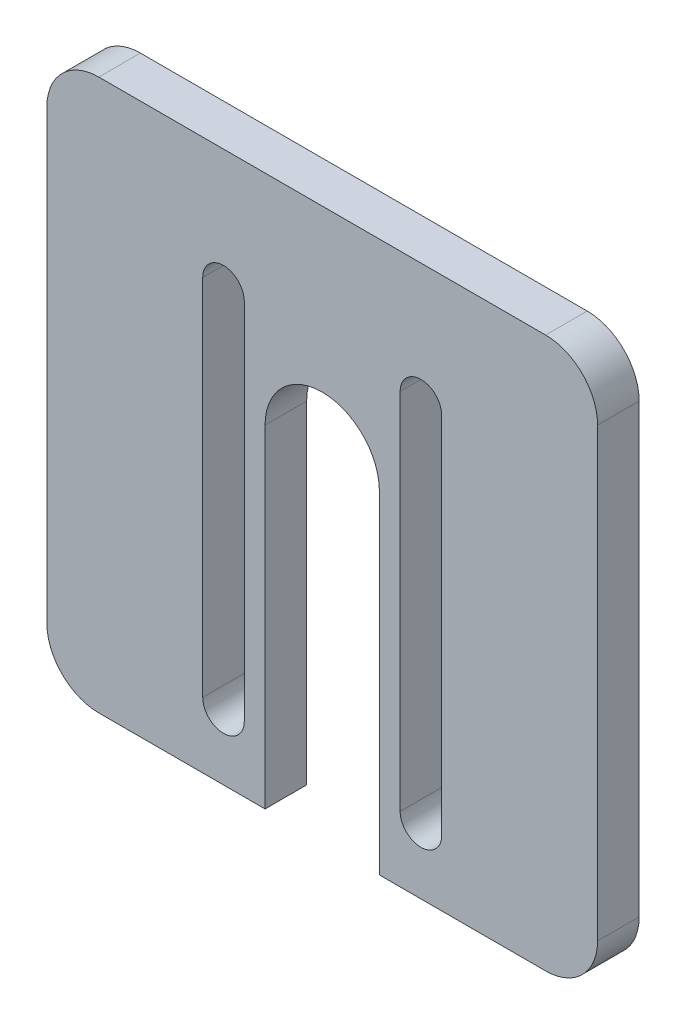
ISO-10303-21;
HEADER;
FILE_DESCRIPTION(('STEP AP214'),'2;1');
FILE_NAME('part.step','',(''),(''),'','','');
FILE_SCHEMA(('AUTOMOTIVE_DESIGN { 1 0 10303 214 1 1 1 1 }'));
ENDSEC;
DATA;
#1=APPLICATION_CONTEXT('core data for automotive mechanical design processes');
#2=APPLICATION_PROTOCOL_DEFINITION('international standard','automotive_design',2000,#1);
#3=PRODUCT_CONTEXT('',#1,'mechanical');
#4=PRODUCT('Part','Part','',(#3));
#5=PRODUCT_RELATED_PRODUCT_CATEGORY('part','',(#4));
#6=PRODUCT_DEFINITION_FORMATION('','',#4);
#7=PRODUCT_DEFINITION_CONTEXT('part definition',#1,'design');
#8=PRODUCT_DEFINITION('design','',#6,#7);
#9=PRODUCT_DEFINITION_SHAPE('','',#8);
#10=(LENGTH_UNIT() NAMED_UNIT(*) SI_UNIT(.MILLI.,.METRE.));
#11=(NAMED_UNIT(*) PLANE_ANGLE_UNIT() SI_UNIT($,.RADIAN.));
#12=(NAMED_UNIT(*) SI_UNIT($,.STERADIAN.) SOLID_ANGLE_UNIT());
#13=UNCERTAINTY_MEASURE_WITH_UNIT(LENGTH_MEASURE(1.E-05),#10,'distance_accuracy_value','');
#14=(GEOMETRIC_REPRESENTATION_CONTEXT(3) GLOBAL_UNCERTAINTY_ASSIGNED_CONTEXT((#13)) GLOBAL_UNIT_ASSIGNED_CONTEXT((#10,
#11,#12)) REPRESENTATION_CONTEXT('',''));
#15=CARTESIAN_POINT('',(0.,0.,0.));
#16=DIRECTION('',(0.,0.,1.));
#17=DIRECTION('',(1.,0.,0.));
#18=AXIS2_PLACEMENT_3D('',#15,#16,#17);
#19=CARTESIAN_POINT('',(17.,6.30020621537469,4.));
#20=DIRECTION('',(0.,0.,-1.));
#21=DIRECTION('',(-1.,0.,0.));
#22=AXIS2_PLACEMENT_3D('',#19,#20,#21);
#23=CYLINDRICAL_SURFACE('',#22,2.);
#24=CARTESIAN_POINT('',(17.,6.30020621537469,0.));
#25=DIRECTION('',(0.,0.,1.));
#26=DIRECTION('',(1.,0.,0.));
#27=AXIS2_PLACEMENT_3D('',#24,#25,#26);
#28=CIRCLE('',#27,2.);
#29=CARTESIAN_POINT('',(15.,6.30020621537469,0.));
#30=VERTEX_POINT('',#29);
#31=CARTESIAN_POINT('',(19.,6.30020621537469,0.));
#32=VERTEX_POINT('',#31);
#33=EDGE_CURVE('E332',#30,#32,#28,.T.);
#34=ORIENTED_EDGE('',*,*,#33,.F.);
#35=DIRECTION('',(0.,0.,-1.));
#36=VECTOR('',#35,1.);
#37=CARTESIAN_POINT('',(15.,6.30020621537469,4.));
#38=LINE('',#37,#36);
#39=CARTESIAN_POINT('',(15.,6.30020621537469,4.));
#40=VERTEX_POINT('',#39);
#41=EDGE_CURVE('E11',#40,#30,#38,.T.);
#42=ORIENTED_EDGE('',*,*,#41,.F.);
#43=CARTESIAN_POINT('',(17.,6.30020621537469,4.));
#44=DIRECTION('',(0.,0.,1.));
#45=DIRECTION('',(1.,0.,0.));
#46=AXIS2_PLACEMENT_3D('',#43,#44,#45);
#47=CIRCLE('',#46,2.);
#48=CARTESIAN_POINT('',(19.,6.30020621537469,4.));
#49=VERTEX_POINT('',#48);
#50=EDGE_CURVE('E198',#40,#49,#47,.T.);
#51=ORIENTED_EDGE('',*,*,#50,.T.);
#52=DIRECTION('',(0.,0.,-1.));
#53=VECTOR('',#52,1.);
#54=CARTESIAN_POINT('',(19.,6.30020621537469,4.));
#55=LINE('',#54,#53);
#56=EDGE_CURVE('E59',#49,#32,#55,.T.);
#57=ORIENTED_EDGE('',*,*,#56,.T.);
#58=EDGE_LOOP('',(#34,#42,#51,#57));
#59=FACE_BOUND('',#58,.T.);
#60=ADVANCED_FACE('F39',(#59),#23,.F.);
#61=CARTESIAN_POINT('',(15.,0.,4.));
#62=DIRECTION('',(-1.,0.,0.));
#63=DIRECTION('',(0.,0.,1.));
#64=AXIS2_PLACEMENT_3D('',#61,#62,#63);
#65=PLANE('',#64);
#66=DIRECTION('',(0.,1.,0.));
#67=VECTOR('',#66,1.);
#68=CARTESIAN_POINT('',(15.,0.,0.));
#69=LINE('',#68,#67);
#70=CARTESIAN_POINT('',(15.,41.3002062153747,0.));
#71=VERTEX_POINT('',#70);
#72=EDGE_CURVE('E204',#30,#71,#69,.T.);
#73=ORIENTED_EDGE('',*,*,#72,.T.);
#74=DIRECTION('',(0.,0.,-1.));
#75=VECTOR('',#74,1.);
#76=CARTESIAN_POINT('',(15.,41.3002062153747,4.));
#77=LINE('',#76,#75);
#78=CARTESIAN_POINT('',(15.,41.3002062153747,4.));
#79=VERTEX_POINT('',#78);
#80=EDGE_CURVE('E50',#79,#71,#77,.T.);
#81=ORIENTED_EDGE('',*,*,#80,.F.);
#82=DIRECTION('',(0.,1.,0.));
#83=VECTOR('',#82,1.);
#84=CARTESIAN_POINT('',(15.,0.,4.));
#85=LINE('',#84,#83);
#86=EDGE_CURVE('E193',#40,#79,#85,.T.);
#87=ORIENTED_EDGE('',*,*,#86,.F.);
#88=ORIENTED_EDGE('',*,*,#41,.T.);
#89=EDGE_LOOP('',(#73,#81,#87,#88));
#90=FACE_BOUND('',#89,.T.);
#91=ADVANCED_FACE('F202',(#90),#65,.F.);
#92=CARTESIAN_POINT('',(17.,41.3002062153747,4.));
#93=DIRECTION('',(0.,0.,-1.));
#94=DIRECTION('',(-1.,0.,0.));
#95=AXIS2_PLACEMENT_3D('',#92,#93,#94);
#96=CYLINDRICAL_SURFACE('',#95,2.);
#97=CARTESIAN_POINT('',(17.,41.3002062153747,0.));
#98=DIRECTION('',(0.,0.,1.));
#99=DIRECTION('',(1.,0.,0.));
#100=AXIS2_PLACEMENT_3D('',#97,#98,#99);
#101=CIRCLE('',#100,2.);
#102=CARTESIAN_POINT('',(19.,41.3002062153747,0.));
#103=VERTEX_POINT('',#102);
#104=EDGE_CURVE('E337',#71,#103,#101,.F.);
#105=ORIENTED_EDGE('',*,*,#104,.T.);
#106=DIRECTION('',(0.,0.,-1.));
#107=VECTOR('',#106,1.);
#108=CARTESIAN_POINT('',(19.,41.3002062153747,4.));
#109=LINE('',#108,#107);
#110=CARTESIAN_POINT('',(19.,41.3002062153747,4.));
#111=VERTEX_POINT('',#110);
#112=EDGE_CURVE('E121',#111,#103,#109,.T.);
#113=ORIENTED_EDGE('',*,*,#112,.F.);
#114=CARTESIAN_POINT('',(17.,41.3002062153747,4.));
#115=DIRECTION('',(0.,0.,1.));
#116=DIRECTION('',(1.,0.,0.));
#117=AXIS2_PLACEMENT_3D('',#114,#115,#116);
#118=CIRCLE('',#117,2.);
#119=EDGE_CURVE('E184',#79,#111,#118,.F.);
#120=ORIENTED_EDGE('',*,*,#119,.F.);
#121=ORIENTED_EDGE('',*,*,#80,.T.);
#122=EDGE_LOOP('',(#105,#113,#120,#121));
#123=FACE_BOUND('',#122,.T.);
#124=ADVANCED_FACE('F186',(#123),#96,.F.);
#125=CARTESIAN_POINT('',(36.,41.3002062153747,4.));
#126=DIRECTION('',(0.,0.,-1.));
#127=DIRECTION('',(-1.,0.,0.));
#128=AXIS2_PLACEMENT_3D('',#125,#126,#127);
#129=CYLINDRICAL_SURFACE('',#128,2.);
#130=CARTESIAN_POINT('',(36.,41.3002062153747,0.));
#131=DIRECTION('',(0.,0.,1.));
#132=DIRECTION('',(1.,0.,0.));
#133=AXIS2_PLACEMENT_3D('',#130,#131,#132);
#134=CIRCLE('',#133,2.);
#135=CARTESIAN_POINT('',(38.,41.3002062153747,0.));
#136=VERTEX_POINT('',#135);
#137=CARTESIAN_POINT('',(34.,41.3002062153747,0.));
#138=VERTEX_POINT('',#137);
#139=EDGE_CURVE('E316',#136,#138,#134,.T.);
#140=ORIENTED_EDGE('',*,*,#139,.F.);
#141=DIRECTION('',(0.,0.,-1.));
#142=VECTOR('',#141,1.);
#143=CARTESIAN_POINT('',(38.,41.3002062153747,4.));
#144=LINE('',#143,#142);
#145=CARTESIAN_POINT('',(38.,41.3002062153747,4.));
#146=VERTEX_POINT('',#145);
#147=EDGE_CURVE('E221',#146,#136,#144,.T.);
#148=ORIENTED_EDGE('',*,*,#147,.F.);
#149=CARTESIAN_POINT('',(36.,41.3002062153747,4.));
#150=DIRECTION('',(0.,0.,1.));
#151=DIRECTION('',(1.,0.,0.));
#152=AXIS2_PLACEMENT_3D('',#149,#150,#151);
#153=CIRCLE('',#152,2.);
#154=CARTESIAN_POINT('',(34.,41.3002062153747,4.));
#155=VERTEX_POINT('',#154);
#156=EDGE_CURVE('E386',#146,#155,#153,.T.);
#157=ORIENTED_EDGE('',*,*,#156,.T.);
#158=DIRECTION('',(0.,0.,-1.));
#159=VECTOR('',#158,1.);
#160=CARTESIAN_POINT('',(34.,41.3002062153747,4.));
#161=LINE('',#160,#159);
#162=EDGE_CURVE('E211',#155,#138,#161,.T.);
#163=ORIENTED_EDGE('',*,*,#162,.T.);
#164=EDGE_LOOP('',(#140,#148,#157,#163));
#165=FACE_BOUND('',#164,.T.);
#166=ADVANCED_FACE('F436',(#165),#129,.F.);
#167=CARTESIAN_POINT('',(38.,0.,4.));
#168=DIRECTION('',(-1.,0.,0.));
#169=DIRECTION('',(0.,-1.,0.));
#170=AXIS2_PLACEMENT_3D('',#167,#168,#169);
#171=PLANE('',#170);
#172=DIRECTION('',(0.,1.,0.));
#173=VECTOR('',#172,1.);
#174=CARTESIAN_POINT('',(38.,0.,0.));
#175=LINE('',#174,#173);
#176=CARTESIAN_POINT('',(38.,6.30020621537469,0.));
#177=VERTEX_POINT('',#176);
#178=EDGE_CURVE('E320',#177,#136,#175,.T.);
#179=ORIENTED_EDGE('',*,*,#178,.F.);
#180=DIRECTION('',(0.,0.,-1.));
#181=VECTOR('',#180,1.);
#182=CARTESIAN_POINT('',(38.,6.30020621537469,4.));
#183=LINE('',#182,#181);
#184=CARTESIAN_POINT('',(38.,6.30020621537469,4.));
#185=VERTEX_POINT('',#184);
#186=EDGE_CURVE('E218',#185,#177,#183,.T.);
#187=ORIENTED_EDGE('',*,*,#186,.F.);
#188=DIRECTION('',(0.,1.,0.));
#189=VECTOR('',#188,1.);
#190=CARTESIAN_POINT('',(38.,0.,4.));
#191=LINE('',#190,#189);
#192=EDGE_CURVE('E390',#185,#146,#191,.T.);
#193=ORIENTED_EDGE('',*,*,#192,.T.);
#194=ORIENTED_EDGE('',*,*,#147,.T.);
#195=EDGE_LOOP('',(#179,#187,#193,#194));
#196=FACE_BOUND('',#195,.T.);
#197=ADVANCED_FACE('F432',(#196),#171,.T.);
#198=CARTESIAN_POINT('',(36.,6.30020621537469,4.));
#199=DIRECTION('',(0.,0.,-1.));
#200=DIRECTION('',(-1.,0.,0.));
#201=AXIS2_PLACEMENT_3D('',#198,#199,#200);
#202=CYLINDRICAL_SURFACE('',#201,2.);
#203=CARTESIAN_POINT('',(36.,6.30020621537469,0.));
#204=DIRECTION('',(0.,0.,1.));
#205=DIRECTION('',(1.,0.,0.));
#206=AXIS2_PLACEMENT_3D('',#203,#204,#205);
#207=CIRCLE('',#206,2.);
#208=CARTESIAN_POINT('',(34.,6.30020621537469,0.));
#209=VERTEX_POINT('',#208);
#210=EDGE_CURVE('E324',#177,#209,#207,.F.);
#211=ORIENTED_EDGE('',*,*,#210,.T.);
#212=DIRECTION('',(0.,0.,-1.));
#213=VECTOR('',#212,1.);
#214=CARTESIAN_POINT('',(34.,6.30020621537469,4.));
#215=LINE('',#214,#213);
#216=CARTESIAN_POINT('',(34.,6.30020621537469,4.));
#217=VERTEX_POINT('',#216);
#218=EDGE_CURVE('E214',#217,#209,#215,.T.);
#219=ORIENTED_EDGE('',*,*,#218,.F.);
#220=CARTESIAN_POINT('',(36.,6.30020621537469,4.));
#221=DIRECTION('',(0.,0.,1.));
#222=DIRECTION('',(1.,0.,0.));
#223=AXIS2_PLACEMENT_3D('',#220,#221,#222);
#224=CIRCLE('',#223,2.);
#225=EDGE_CURVE('E394',#185,#217,#224,.F.);
#226=ORIENTED_EDGE('',*,*,#225,.F.);
#227=ORIENTED_EDGE('',*,*,#186,.T.);
#228=EDGE_LOOP('',(#211,#219,#226,#227));
#229=FACE_BOUND('',#228,.T.);
#230=ADVANCED_FACE('F429',(#229),#202,.F.);
#231=CARTESIAN_POINT('',(5.,48.,4.));
#232=DIRECTION('',(0.,0.,-1.));
#233=DIRECTION('',(-1.,0.,0.));
#234=AXIS2_PLACEMENT_3D('',#231,#232,#233);
#235=CYLINDRICAL_SURFACE('',#234,5.);
#236=CARTESIAN_POINT('',(5.,48.,0.));
#237=DIRECTION('',(0.,0.,1.));
#238=DIRECTION('',(1.,0.,0.));
#239=AXIS2_PLACEMENT_3D('',#236,#237,#238);
#240=CIRCLE('',#239,5.);
#241=CARTESIAN_POINT('',(0.,48.,0.));
#242=VERTEX_POINT('',#241);
#243=CARTESIAN_POINT('',(5.00000000000004,53.,0.));
#244=VERTEX_POINT('',#243);
#245=EDGE_CURVE('E270',#242,#244,#240,.F.);
#246=ORIENTED_EDGE('',*,*,#245,.F.);
#247=DIRECTION('',(0.,0.,-1.));
#248=VECTOR('',#247,1.);
#249=CARTESIAN_POINT('',(0.,48.,4.));
#250=LINE('',#249,#248);
#251=CARTESIAN_POINT('',(0.,48.,4.));
#252=VERTEX_POINT('',#251);
#253=EDGE_CURVE('E43',#252,#242,#250,.T.);
#254=ORIENTED_EDGE('',*,*,#253,.F.);
#255=CARTESIAN_POINT('',(5.,48.,4.));
#256=DIRECTION('',(0.,0.,1.));
#257=DIRECTION('',(1.,0.,0.));
#258=AXIS2_PLACEMENT_3D('',#255,#256,#257);
#259=CIRCLE('',#258,5.);
#260=CARTESIAN_POINT('',(5.00000000000004,53.,4.));
#261=VERTEX_POINT('',#260);
#262=EDGE_CURVE('E343',#252,#261,#259,.F.);
#263=ORIENTED_EDGE('',*,*,#262,.T.);
#264=DIRECTION('',(0.,0.,-1.));
#265=VECTOR('',#264,1.);
#266=CARTESIAN_POINT('',(5.00000000000004,53.,4.));
#267=LINE('',#266,#265);
#268=EDGE_CURVE('E224',#261,#244,#267,.T.);
#269=ORIENTED_EDGE('',*,*,#268,.T.);
#270=EDGE_LOOP('',(#246,#254,#263,#269));
#271=FACE_BOUND('',#270,.T.);
#272=ADVANCED_FACE('F41',(#271),#235,.T.);
#273=CARTESIAN_POINT('',(0.,0.,4.));
#274=DIRECTION('',(-1.,0.,0.));
#275=DIRECTION('',(0.,0.,1.));
#276=AXIS2_PLACEMENT_3D('',#273,#274,#275);
#277=PLANE('',#276);
#278=DIRECTION('',(0.,1.,0.));
#279=VECTOR('',#278,1.);
#280=CARTESIAN_POINT('',(0.,0.,0.));
#281=LINE('',#280,#279);
#282=CARTESIAN_POINT('',(0.,5.00000000000004,0.));
#283=VERTEX_POINT('',#282);
#284=EDGE_CURVE('E266',#283,#242,#281,.T.);
#285=ORIENTED_EDGE('',*,*,#284,.F.);
#286=DIRECTION('',(0.,0.,-1.));
#287=VECTOR('',#286,1.);
#288=CARTESIAN_POINT('',(0.,5.00000000000004,4.));
#289=LINE('',#288,#287);
#290=CARTESIAN_POINT('',(0.,5.00000000000004,4.));
#291=VERTEX_POINT('',#290);
#292=EDGE_CURVE('E254',#291,#283,#289,.T.);
#293=ORIENTED_EDGE('',*,*,#292,.F.);
#294=DIRECTION('',(0.,1.,0.));
#295=VECTOR('',#294,1.);
#296=CARTESIAN_POINT('',(0.,0.,4.));
#297=LINE('',#296,#295);
#298=EDGE_CURVE('E268',#291,#252,#297,.T.);
#299=ORIENTED_EDGE('',*,*,#298,.T.);
#300=ORIENTED_EDGE('',*,*,#253,.T.);
#301=EDGE_LOOP('',(#285,#293,#299,#300));
#302=FACE_BOUND('',#301,.T.);
#303=ADVANCED_FACE('F264',(#302),#277,.T.);
#304=CARTESIAN_POINT('',(5.,5.,4.));
#305=DIRECTION('',(0.,0.,-1.));
#306=DIRECTION('',(-1.,0.,0.));
#307=AXIS2_PLACEMENT_3D('',#304,#305,#306);
#308=CYLINDRICAL_SURFACE('',#307,5.);
#309=CARTESIAN_POINT('',(5.,5.,0.));
#310=DIRECTION('',(0.,0.,1.));
#311=DIRECTION('',(1.,0.,0.));
#312=AXIS2_PLACEMENT_3D('',#309,#310,#311);
#313=CIRCLE('',#312,5.);
#314=CARTESIAN_POINT('',(5.00000000000004,0.,0.));
#315=VERTEX_POINT('',#314);
#316=EDGE_CURVE('E279',#283,#315,#313,.T.);
#317=ORIENTED_EDGE('',*,*,#316,.T.);
#318=DIRECTION('',(0.,0.,-1.));
#319=VECTOR('',#318,1.);
#320=CARTESIAN_POINT('',(5.00000000000004,0.,4.));
#321=LINE('',#320,#319);
#322=CARTESIAN_POINT('',(5.00000000000004,0.,4.));
#323=VERTEX_POINT('',#322);
#324=EDGE_CURVE('E252',#323,#315,#321,.T.);
#325=ORIENTED_EDGE('',*,*,#324,.F.);
#326=CARTESIAN_POINT('',(5.,5.,4.));
#327=DIRECTION('',(0.,0.,1.));
#328=DIRECTION('',(1.,0.,0.));
#329=AXIS2_PLACEMENT_3D('',#326,#327,#328);
#330=CIRCLE('',#329,5.);
#331=EDGE_CURVE('E350',#291,#323,#330,.T.);
#332=ORIENTED_EDGE('',*,*,#331,.F.);
#333=ORIENTED_EDGE('',*,*,#292,.T.);
#334=EDGE_LOOP('',(#317,#325,#332,#333));
#335=FACE_BOUND('',#334,.T.);
#336=ADVANCED_FACE('F469',(#335),#308,.T.);
#337=CARTESIAN_POINT('',(0.,0.,4.));
#338=DIRECTION('',(0.,-1.,0.));
#339=DIRECTION('',(1.,0.,0.));
#340=AXIS2_PLACEMENT_3D('',#337,#338,#339);
#341=PLANE('',#340);
#342=DIRECTION('',(-1.,0.,0.));
#343=VECTOR('',#342,1.);
#344=CARTESIAN_POINT('',(0.,0.,0.));
#345=LINE('',#344,#343);
#346=CARTESIAN_POINT('',(21.,0.,0.));
#347=VERTEX_POINT('',#346);
#348=EDGE_CURVE('E283',#347,#315,#345,.T.);
#349=ORIENTED_EDGE('',*,*,#348,.F.);
#350=DIRECTION('',(0.,0.,-1.));
#351=VECTOR('',#350,1.);
#352=CARTESIAN_POINT('',(21.,0.,4.));
#353=LINE('',#352,#351);
#354=CARTESIAN_POINT('',(21.,0.,4.));
#355=VERTEX_POINT('',#354);
#356=EDGE_CURVE('E249',#355,#347,#353,.T.);
#357=ORIENTED_EDGE('',*,*,#356,.F.);
#358=DIRECTION('',(-1.,0.,0.));
#359=VECTOR('',#358,1.);
#360=CARTESIAN_POINT('',(0.,0.,4.));
#361=LINE('',#360,#359);
#362=EDGE_CURVE('E355',#355,#323,#361,.T.);
#363=ORIENTED_EDGE('',*,*,#362,.T.);
#364=ORIENTED_EDGE('',*,*,#324,.T.);
#365=EDGE_LOOP('',(#349,#357,#363,#364));
#366=FACE_BOUND('',#365,.T.);
#367=ADVANCED_FACE('F457',(#366),#341,.T.);
#368=CARTESIAN_POINT('',(21.,0.,4.));
#369=DIRECTION('',(1.,0.,0.));
#370=DIRECTION('',(0.,0.,-1.));
#371=AXIS2_PLACEMENT_3D('',#368,#369,#370);
#372=PLANE('',#371);
#373=DIRECTION('',(0.,-1.,0.));
#374=VECTOR('',#373,1.);
#375=CARTESIAN_POINT('',(21.,0.,0.));
#376=LINE('',#375,#374);
#377=CARTESIAN_POINT('',(21.,31.9949965699704,0.));
#378=VERTEX_POINT('',#377);
#379=EDGE_CURVE('E289',#378,#347,#376,.T.);
#380=ORIENTED_EDGE('',*,*,#379,.F.);
#381=DIRECTION('',(0.,0.,-1.));
#382=VECTOR('',#381,1.);
#383=CARTESIAN_POINT('',(21.,31.9949965699704,4.));
#384=LINE('',#383,#382);
#385=CARTESIAN_POINT('',(21.,31.9949965699704,4.));
#386=VERTEX_POINT('',#385);
#387=EDGE_CURVE('E246',#386,#378,#384,.T.);
#388=ORIENTED_EDGE('',*,*,#387,.F.);
#389=DIRECTION('',(0.,-1.,0.));
#390=VECTOR('',#389,1.);
#391=CARTESIAN_POINT('',(21.,0.,4.));
#392=LINE('',#391,#390);
#393=EDGE_CURVE('E359',#386,#355,#392,.T.);
#394=ORIENTED_EDGE('',*,*,#393,.T.);
#395=ORIENTED_EDGE('',*,*,#356,.T.);
#396=EDGE_LOOP('',(#380,#388,#394,#395));
#397=FACE_BOUND('',#396,.T.);
#398=ADVANCED_FACE('F464',(#397),#372,.T.);
#399=CARTESIAN_POINT('',(26.5,31.9949965699704,4.));
#400=DIRECTION('',(0.,0.,-1.));
#401=DIRECTION('',(-1.,0.,0.));
#402=AXIS2_PLACEMENT_3D('',#399,#400,#401);
#403=CYLINDRICAL_SURFACE('',#402,5.5);
#404=CARTESIAN_POINT('',(26.5,31.9949965699704,0.));
#405=DIRECTION('',(0.,0.,1.));
#406=DIRECTION('',(1.,0.,0.));
#407=AXIS2_PLACEMENT_3D('',#404,#405,#406);
#408=CIRCLE('',#407,5.5);
#409=CARTESIAN_POINT('',(32.,31.9949965699704,0.));
#410=VERTEX_POINT('',#409);
#411=EDGE_CURVE('E294',#378,#410,#408,.F.);
#412=ORIENTED_EDGE('',*,*,#411,.T.);
#413=DIRECTION('',(0.,0.,-1.));
#414=VECTOR('',#413,1.);
#415=CARTESIAN_POINT('',(32.,31.9949965699704,4.));
#416=LINE('',#415,#414);
#417=CARTESIAN_POINT('',(32.,31.9949965699704,4.));
#418=VERTEX_POINT('',#417);
#419=EDGE_CURVE('E242',#418,#410,#416,.T.);
#420=ORIENTED_EDGE('',*,*,#419,.F.);
#421=CARTESIAN_POINT('',(26.5,31.9949965699704,4.));
#422=DIRECTION('',(0.,0.,1.));
#423=DIRECTION('',(1.,0.,0.));
#424=AXIS2_PLACEMENT_3D('',#421,#422,#423);
#425=CIRCLE('',#424,5.5);
#426=EDGE_CURVE('E364',#386,#418,#425,.F.);
#427=ORIENTED_EDGE('',*,*,#426,.F.);
#428=ORIENTED_EDGE('',*,*,#387,.T.);
#429=EDGE_LOOP('',(#412,#420,#427,#428));
#430=FACE_BOUND('',#429,.T.);
#431=ADVANCED_FACE('F460',(#430),#403,.F.);
#432=CARTESIAN_POINT('',(32.,0.,4.));
#433=DIRECTION('',(1.,0.,0.));
#434=DIRECTION('',(0.,0.,-1.));
#435=AXIS2_PLACEMENT_3D('',#432,#433,#434);
#436=PLANE('',#435);
#437=DIRECTION('',(0.,-1.,0.));
#438=VECTOR('',#437,1.);
#439=CARTESIAN_POINT('',(32.,0.,0.));
#440=LINE('',#439,#438);
#441=CARTESIAN_POINT('',(32.,0.,0.));
#442=VERTEX_POINT('',#441);
#443=EDGE_CURVE('E297',#410,#442,#440,.T.);
#444=ORIENTED_EDGE('',*,*,#443,.T.);
#445=DIRECTION('',(0.,0.,-1.));
#446=VECTOR('',#445,1.);
#447=CARTESIAN_POINT('',(32.,0.,4.));
#448=LINE('',#447,#446);
#449=CARTESIAN_POINT('',(32.,0.,4.));
#450=VERTEX_POINT('',#449);
#451=EDGE_CURVE('E239',#450,#442,#448,.T.);
#452=ORIENTED_EDGE('',*,*,#451,.F.);
#453=DIRECTION('',(0.,-1.,0.));
#454=VECTOR('',#453,1.);
#455=CARTESIAN_POINT('',(32.,0.,4.));
#456=LINE('',#455,#454);
#457=EDGE_CURVE('E367',#418,#450,#456,.T.);
#458=ORIENTED_EDGE('',*,*,#457,.F.);
#459=ORIENTED_EDGE('',*,*,#419,.T.);
#460=EDGE_LOOP('',(#444,#452,#458,#459));
#461=FACE_BOUND('',#460,.T.);
#462=ADVANCED_FACE('F455',(#461),#436,.F.);
#463=CARTESIAN_POINT('',(48.,0.,0.));
#464=VERTEX_POINT('',#463);
#465=EDGE_CURVE('E290',#464,#442,#345,.T.);
#466=ORIENTED_EDGE('',*,*,#465,.F.);
#467=DIRECTION('',(0.,0.,-1.));
#468=VECTOR('',#467,1.);
#469=CARTESIAN_POINT('',(48.,0.,4.));
#470=LINE('',#469,#468);
#471=CARTESIAN_POINT('',(48.,0.,4.));
#472=VERTEX_POINT('',#471);
#473=EDGE_CURVE('E236',#472,#464,#470,.T.);
#474=ORIENTED_EDGE('',*,*,#473,.F.);
#475=EDGE_CURVE('E360',#472,#450,#361,.T.);
#476=ORIENTED_EDGE('',*,*,#475,.T.);
#477=ORIENTED_EDGE('',*,*,#451,.T.);
#478=EDGE_LOOP('',(#466,#474,#476,#477));
#479=FACE_BOUND('',#478,.T.);
#480=ADVANCED_FACE('F451',(#479),#341,.T.);
#481=CARTESIAN_POINT('',(48.,5.,4.));
#482=DIRECTION('',(0.,0.,-1.));
#483=DIRECTION('',(-1.,0.,0.));
#484=AXIS2_PLACEMENT_3D('',#481,#482,#483);
#485=CYLINDRICAL_SURFACE('',#484,5.);
#486=CARTESIAN_POINT('',(48.,5.,0.));
#487=DIRECTION('',(0.,0.,1.));
#488=DIRECTION('',(1.,0.,0.));
#489=AXIS2_PLACEMENT_3D('',#486,#487,#488);
#490=CIRCLE('',#489,5.);
#491=CARTESIAN_POINT('',(53.,5.00000000000004,0.));
#492=VERTEX_POINT('',#491);
#493=EDGE_CURVE('E301',#492,#464,#490,.F.);
#494=ORIENTED_EDGE('',*,*,#493,.F.);
#495=DIRECTION('',(0.,0.,-1.));
#496=VECTOR('',#495,1.);
#497=CARTESIAN_POINT('',(53.,5.00000000000004,4.));
#498=LINE('',#497,#496);
#499=CARTESIAN_POINT('',(53.,5.00000000000004,4.));
#500=VERTEX_POINT('',#499);
#501=EDGE_CURVE('E233',#500,#492,#498,.T.);
#502=ORIENTED_EDGE('',*,*,#501,.F.);
#503=CARTESIAN_POINT('',(48.,5.,4.));
#504=DIRECTION('',(0.,0.,1.));
#505=DIRECTION('',(1.,0.,0.));
#506=AXIS2_PLACEMENT_3D('',#503,#504,#505);
#507=CIRCLE('',#506,5.);
#508=EDGE_CURVE('E370',#500,#472,#507,.F.);
#509=ORIENTED_EDGE('',*,*,#508,.T.);
#510=ORIENTED_EDGE('',*,*,#473,.T.);
#511=EDGE_LOOP('',(#494,#502,#509,#510));
#512=FACE_BOUND('',#511,.T.);
#513=ADVANCED_FACE('F447',(#512),#485,.T.);
#514=CARTESIAN_POINT('',(53.,0.,4.));
#515=DIRECTION('',(1.,0.,0.));
#516=DIRECTION('',(0.,1.,0.));
#517=AXIS2_PLACEMENT_3D('',#514,#515,#516);
#518=PLANE('',#517);
#519=DIRECTION('',(0.,-1.,0.));
#520=VECTOR('',#519,1.);
#521=CARTESIAN_POINT('',(53.,0.,0.));
#522=LINE('',#521,#520);
#523=CARTESIAN_POINT('',(53.,48.,0.));
#524=VERTEX_POINT('',#523);
#525=EDGE_CURVE('E305',#524,#492,#522,.T.);
#526=ORIENTED_EDGE('',*,*,#525,.F.);
#527=DIRECTION('',(0.,0.,-1.));
#528=VECTOR('',#527,1.);
#529=CARTESIAN_POINT('',(53.,48.,4.));
#530=LINE('',#529,#528);
#531=CARTESIAN_POINT('',(53.,48.,4.));
#532=VERTEX_POINT('',#531);
#533=EDGE_CURVE('E230',#532,#524,#530,.T.);
#534=ORIENTED_EDGE('',*,*,#533,.F.);
#535=DIRECTION('',(0.,-1.,0.));
#536=VECTOR('',#535,1.);
#537=CARTESIAN_POINT('',(53.,0.,4.));
#538=LINE('',#537,#536);
#539=EDGE_CURVE('E374',#532,#500,#538,.T.);
#540=ORIENTED_EDGE('',*,*,#539,.T.);
#541=ORIENTED_EDGE('',*,*,#501,.T.);
#542=EDGE_LOOP('',(#526,#534,#540,#541));
#543=FACE_BOUND('',#542,.T.);
#544=ADVANCED_FACE('F443',(#543),#518,.T.);
#545=CARTESIAN_POINT('',(48.,48.,4.));
#546=DIRECTION('',(0.,0.,-1.));
#547=DIRECTION('',(-1.,0.,0.));
#548=AXIS2_PLACEMENT_3D('',#545,#546,#547);
#549=CYLINDRICAL_SURFACE('',#548,5.);
#550=CARTESIAN_POINT('',(48.,48.,0.));
#551=DIRECTION('',(0.,0.,1.));
#552=DIRECTION('',(1.,0.,0.));
#553=AXIS2_PLACEMENT_3D('',#550,#551,#552);
#554=CIRCLE('',#553,5.);
#555=CARTESIAN_POINT('',(48.,53.,0.));
#556=VERTEX_POINT('',#555);
#557=EDGE_CURVE('E309',#556,#524,#554,.F.);
#558=ORIENTED_EDGE('',*,*,#557,.F.);
#559=DIRECTION('',(0.,0.,-1.));
#560=VECTOR('',#559,1.);
#561=CARTESIAN_POINT('',(48.,53.,4.));
#562=LINE('',#561,#560);
#563=CARTESIAN_POINT('',(48.,53.,4.));
#564=VERTEX_POINT('',#563);
#565=EDGE_CURVE('E227',#564,#556,#562,.T.);
#566=ORIENTED_EDGE('',*,*,#565,.F.);
#567=CARTESIAN_POINT('',(48.,48.,4.));
#568=DIRECTION('',(0.,0.,1.));
#569=DIRECTION('',(1.,0.,0.));
#570=AXIS2_PLACEMENT_3D('',#567,#568,#569);
#571=CIRCLE('',#570,5.);
#572=EDGE_CURVE('E378',#564,#532,#571,.F.);
#573=ORIENTED_EDGE('',*,*,#572,.T.);
#574=ORIENTED_EDGE('',*,*,#533,.T.);
#575=EDGE_LOOP('',(#558,#566,#573,#574));
#576=FACE_BOUND('',#575,.T.);
#577=ADVANCED_FACE('F427',(#576),#549,.T.);
#578=CARTESIAN_POINT('',(34.,0.,4.));
#579=DIRECTION('',(-1.,0.,0.));
#580=DIRECTION('',(0.,-1.,0.));
#581=AXIS2_PLACEMENT_3D('',#578,#579,#580);
#582=PLANE('',#581);
#583=DIRECTION('',(0.,1.,0.));
#584=VECTOR('',#583,1.);
#585=CARTESIAN_POINT('',(34.,0.,0.));
#586=LINE('',#585,#584);
#587=EDGE_CURVE('E328',#209,#138,#586,.T.);
#588=ORIENTED_EDGE('',*,*,#587,.T.);
#589=ORIENTED_EDGE('',*,*,#162,.F.);
#590=DIRECTION('',(0.,1.,0.));
#591=VECTOR('',#590,1.);
#592=CARTESIAN_POINT('',(34.,0.,4.));
#593=LINE('',#592,#591);
#594=EDGE_CURVE('E398',#217,#155,#593,.T.);
#595=ORIENTED_EDGE('',*,*,#594,.F.);
#596=ORIENTED_EDGE('',*,*,#218,.T.);
#597=EDGE_LOOP('',(#588,#589,#595,#596));
#598=FACE_BOUND('',#597,.T.);
#599=ADVANCED_FACE('F413',(#598),#582,.F.);
#600=CARTESIAN_POINT('',(0.,53.,4.));
#601=DIRECTION('',(0.,1.,0.));
#602=DIRECTION('',(0.,0.,1.));
#603=AXIS2_PLACEMENT_3D('',#600,#601,#602);
#604=PLANE('',#603);
#605=DIRECTION('',(1.,0.,0.));
#606=VECTOR('',#605,1.);
#607=CARTESIAN_POINT('',(0.,53.,0.));
#608=LINE('',#607,#606);
#609=EDGE_CURVE('E313',#244,#556,#608,.T.);
#610=ORIENTED_EDGE('',*,*,#609,.F.);
#611=ORIENTED_EDGE('',*,*,#268,.F.);
#612=DIRECTION('',(1.,0.,0.));
#613=VECTOR('',#612,1.);
#614=CARTESIAN_POINT('',(0.,53.,4.));
#615=LINE('',#614,#613);
#616=EDGE_CURVE('E382',#261,#564,#615,.T.);
#617=ORIENTED_EDGE('',*,*,#616,.T.);
#618=ORIENTED_EDGE('',*,*,#565,.T.);
#619=EDGE_LOOP('',(#610,#611,#617,#618));
#620=FACE_BOUND('',#619,.T.);
#621=ADVANCED_FACE('F405',(#620),#604,.T.);
#622=CARTESIAN_POINT('',(19.,0.,4.));
#623=DIRECTION('',(-1.,0.,0.));
#624=DIRECTION('',(0.,0.,1.));
#625=AXIS2_PLACEMENT_3D('',#622,#623,#624);
#626=PLANE('',#625);
#627=DIRECTION('',(0.,1.,0.));
#628=VECTOR('',#627,1.);
#629=CARTESIAN_POINT('',(19.,0.,0.));
#630=LINE('',#629,#628);
#631=EDGE_CURVE('E340',#32,#103,#630,.T.);
#632=ORIENTED_EDGE('',*,*,#631,.F.);
#633=ORIENTED_EDGE('',*,*,#56,.F.);
#634=DIRECTION('',(0.,1.,0.));
#635=VECTOR('',#634,1.);
#636=CARTESIAN_POINT('',(19.,0.,4.));
#637=LINE('',#636,#635);
#638=EDGE_CURVE('E192',#49,#111,#637,.T.);
#639=ORIENTED_EDGE('',*,*,#638,.T.);
#640=ORIENTED_EDGE('',*,*,#112,.T.);
#641=EDGE_LOOP('',(#632,#633,#639,#640));
#642=FACE_BOUND('',#641,.T.);
#643=ADVANCED_FACE('F403',(#642),#626,.T.);
#644=CARTESIAN_POINT('',(0.,0.,4.));
#645=DIRECTION('',(0.,0.,1.));
#646=DIRECTION('',(1.,0.,0.));
#647=AXIS2_PLACEMENT_3D('',#644,#645,#646);
#648=PLANE('',#647);
#649=ORIENTED_EDGE('',*,*,#262,.F.);
#650=ORIENTED_EDGE('',*,*,#298,.F.);
#651=ORIENTED_EDGE('',*,*,#331,.T.);
#652=ORIENTED_EDGE('',*,*,#362,.F.);
#653=ORIENTED_EDGE('',*,*,#393,.F.);
#654=ORIENTED_EDGE('',*,*,#426,.T.);
#655=ORIENTED_EDGE('',*,*,#457,.T.);
#656=ORIENTED_EDGE('',*,*,#475,.F.);
#657=ORIENTED_EDGE('',*,*,#508,.F.);
#658=ORIENTED_EDGE('',*,*,#539,.F.);
#659=ORIENTED_EDGE('',*,*,#572,.F.);
#660=ORIENTED_EDGE('',*,*,#616,.F.);
#661=EDGE_LOOP('',(#649,#650,#651,#652,#653,#654,#655,#656,#657,#658,#659,#660));
#662=FACE_BOUND('',#661,.T.);
#663=ORIENTED_EDGE('',*,*,#156,.F.);
#664=ORIENTED_EDGE('',*,*,#192,.F.);
#665=ORIENTED_EDGE('',*,*,#225,.T.);
#666=ORIENTED_EDGE('',*,*,#594,.T.);
#667=EDGE_LOOP('',(#663,#664,#665,#666));
#668=FACE_BOUND('',#667,.T.);
#669=ORIENTED_EDGE('',*,*,#50,.F.);
#670=ORIENTED_EDGE('',*,*,#86,.T.);
#671=ORIENTED_EDGE('',*,*,#119,.T.);
#672=ORIENTED_EDGE('',*,*,#638,.F.);
#673=EDGE_LOOP('',(#669,#670,#671,#672));
#674=FACE_BOUND('',#673,.T.);
#675=ADVANCED_FACE('F197',(#662,#668,#674),#648,.T.);
#676=CARTESIAN_POINT('',(0.,0.,0.));
#677=DIRECTION('',(0.,0.,1.));
#678=DIRECTION('',(1.,0.,0.));
#679=AXIS2_PLACEMENT_3D('',#676,#677,#678);
#680=PLANE('',#679);
#681=ORIENTED_EDGE('',*,*,#245,.T.);
#682=ORIENTED_EDGE('',*,*,#609,.T.);
#683=ORIENTED_EDGE('',*,*,#557,.T.);
#684=ORIENTED_EDGE('',*,*,#525,.T.);
#685=ORIENTED_EDGE('',*,*,#493,.T.);
#686=ORIENTED_EDGE('',*,*,#465,.T.);
#687=ORIENTED_EDGE('',*,*,#443,.F.);
#688=ORIENTED_EDGE('',*,*,#411,.F.);
#689=ORIENTED_EDGE('',*,*,#379,.T.);
#690=ORIENTED_EDGE('',*,*,#348,.T.);
#691=ORIENTED_EDGE('',*,*,#316,.F.);
#692=ORIENTED_EDGE('',*,*,#284,.T.);
#693=EDGE_LOOP('',(#681,#682,#683,#684,#685,#686,#687,#688,#689,#690,#691,#692));
#694=FACE_BOUND('',#693,.T.);
#695=ORIENTED_EDGE('',*,*,#139,.T.);
#696=ORIENTED_EDGE('',*,*,#587,.F.);
#697=ORIENTED_EDGE('',*,*,#210,.F.);
#698=ORIENTED_EDGE('',*,*,#178,.T.);
#699=EDGE_LOOP('',(#695,#696,#697,#698));
#700=FACE_BOUND('',#699,.T.);
#701=ORIENTED_EDGE('',*,*,#33,.T.);
#702=ORIENTED_EDGE('',*,*,#631,.T.);
#703=ORIENTED_EDGE('',*,*,#104,.F.);
#704=ORIENTED_EDGE('',*,*,#72,.F.);
#705=EDGE_LOOP('',(#701,#702,#703,#704));
#706=FACE_BOUND('',#705,.T.);
#707=ADVANCED_FACE('F276',(#694,#700,#706),#680,.F.);
#708=CLOSED_SHELL('',(#60,#91,#124,#166,#197,#230,#272,#303,#336,#367,#398,#431,#462,#480,#513,
#544,#577,#599,#621,#643,#675,#707));
#709=MANIFOLD_SOLID_BREP('B2',#708);
#710=ADVANCED_BREP_SHAPE_REPRESENTATION('',(#18,#709),#14);
#711=SHAPE_DEFINITION_REPRESENTATION(#9,#710);
ENDSEC;
END-ISO-10303-21;
